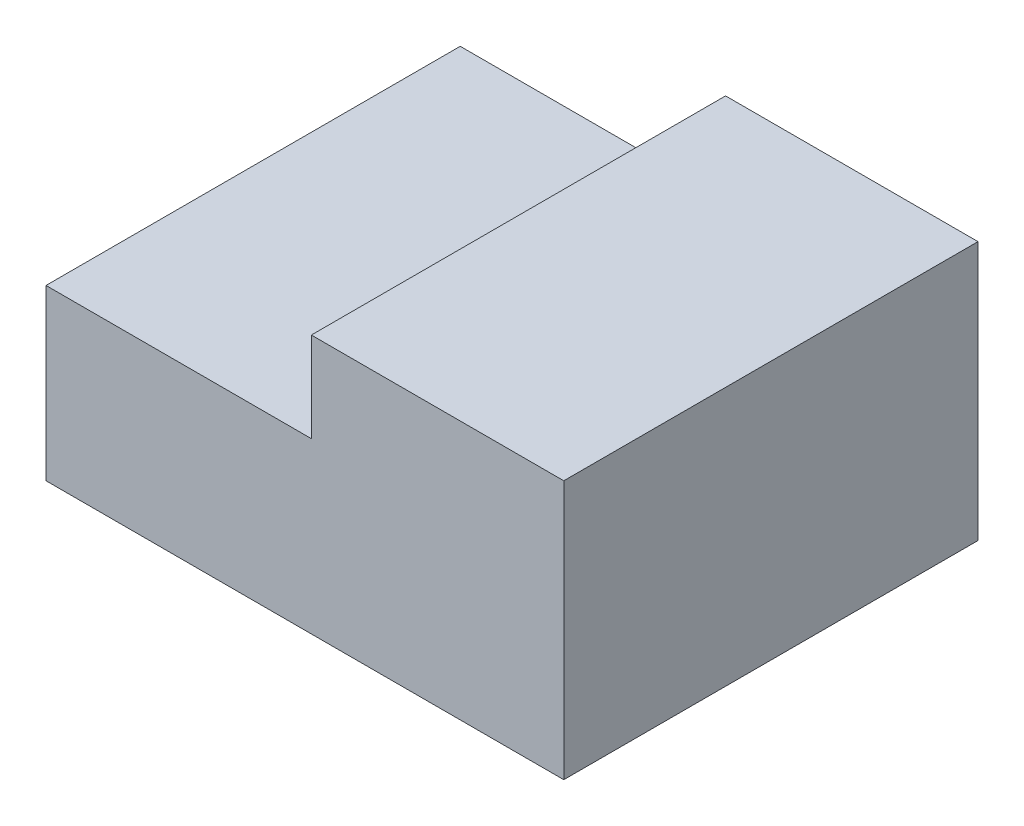
ISO-10303-21;
HEADER;
FILE_DESCRIPTION(('STEP AP214'),'2;1');
FILE_NAME('part.step','',(''),(''),'','','');
FILE_SCHEMA(('AUTOMOTIVE_DESIGN { 1 0 10303 214 1 1 1 1 }'));
ENDSEC;
DATA;
#1=APPLICATION_CONTEXT('core data for automotive mechanical design processes');
#2=APPLICATION_PROTOCOL_DEFINITION('international standard','automotive_design',2000,#1);
#3=PRODUCT_CONTEXT('',#1,'mechanical');
#4=PRODUCT('Part','Part','',(#3));
#5=PRODUCT_RELATED_PRODUCT_CATEGORY('part','',(#4));
#6=PRODUCT_DEFINITION_FORMATION('','',#4);
#7=PRODUCT_DEFINITION_CONTEXT('part definition',#1,'design');
#8=PRODUCT_DEFINITION('design','',#6,#7);
#9=PRODUCT_DEFINITION_SHAPE('','',#8);
#10=(LENGTH_UNIT() NAMED_UNIT(*) SI_UNIT(.MILLI.,.METRE.));
#11=(NAMED_UNIT(*) PLANE_ANGLE_UNIT() SI_UNIT($,.RADIAN.));
#12=(NAMED_UNIT(*) SI_UNIT($,.STERADIAN.) SOLID_ANGLE_UNIT());
#13=UNCERTAINTY_MEASURE_WITH_UNIT(LENGTH_MEASURE(1.E-05),#10,'distance_accuracy_value','');
#14=(GEOMETRIC_REPRESENTATION_CONTEXT(3) GLOBAL_UNCERTAINTY_ASSIGNED_CONTEXT((#13)) GLOBAL_UNIT_ASSIGNED_CONTEXT((#10,
#11,#12)) REPRESENTATION_CONTEXT('',''));
#15=CARTESIAN_POINT('',(0.,0.,0.));
#16=DIRECTION('',(0.,0.,1.));
#17=DIRECTION('',(1.,0.,0.));
#18=AXIS2_PLACEMENT_3D('',#15,#16,#17);
#19=CARTESIAN_POINT('',(-8.08109780569308,75.7063692621199,80.));
#20=DIRECTION('',(-1.,0.,0.));
#21=DIRECTION('',(0.,0.,1.));
#22=AXIS2_PLACEMENT_3D('',#19,#20,#21);
#23=PLANE('',#22);
#24=DIRECTION('',(0.,1.,0.));
#25=VECTOR('',#24,1.);
#26=CARTESIAN_POINT('',(-8.08109780569308,75.7063692621199,0.));
#27=LINE('',#26,#25);
#28=CARTESIAN_POINT('',(-8.08109780569308,25.7063692621199,0.));
#29=VERTEX_POINT('',#28);
#30=CARTESIAN_POINT('',(-8.08109780569308,75.7063692621199,0.));
#31=VERTEX_POINT('',#30);
#32=EDGE_CURVE('E112',#29,#31,#27,.T.);
#33=ORIENTED_EDGE('',*,*,#32,.T.);
#34=DIRECTION('',(0.,0.,-1.));
#35=VECTOR('',#34,1.);
#36=CARTESIAN_POINT('',(-8.08109780569308,75.7063692621199,80.));
#37=LINE('',#36,#35);
#38=CARTESIAN_POINT('',(-8.08109780569308,75.7063692621199,80.));
#39=VERTEX_POINT('',#38);
#40=EDGE_CURVE('E131',#39,#31,#37,.T.);
#41=ORIENTED_EDGE('',*,*,#40,.F.);
#42=DIRECTION('',(0.,1.,0.));
#43=VECTOR('',#42,1.);
#44=CARTESIAN_POINT('',(-8.08109780569308,75.7063692621199,80.));
#45=LINE('',#44,#43);
#46=CARTESIAN_POINT('',(-8.08109780569308,25.7063692621199,80.));
#47=VERTEX_POINT('',#46);
#48=EDGE_CURVE('E113',#47,#39,#45,.T.);
#49=ORIENTED_EDGE('',*,*,#48,.F.);
#50=DIRECTION('',(0.,0.,-1.));
#51=VECTOR('',#50,1.);
#52=CARTESIAN_POINT('',(-8.08109780569308,25.7063692621199,80.));
#53=LINE('',#52,#51);
#54=EDGE_CURVE('E119',#47,#29,#53,.T.);
#55=ORIENTED_EDGE('',*,*,#54,.T.);
#56=EDGE_LOOP('',(#33,#41,#49,#55));
#57=FACE_BOUND('',#56,.T.);
#58=ADVANCED_FACE('F33',(#57),#23,.F.);
#59=CARTESIAN_POINT('',(-108.081097805693,75.7063692621199,80.));
#60=DIRECTION('',(0.,-1.,0.));
#61=DIRECTION('',(0.,0.,-1.));
#62=AXIS2_PLACEMENT_3D('',#59,#60,#61);
#63=PLANE('',#62);
#64=DIRECTION('',(-1.,0.,0.));
#65=VECTOR('',#64,1.);
#66=CARTESIAN_POINT('',(-108.081097805693,75.7063692621199,0.));
#67=LINE('',#66,#65);
#68=CARTESIAN_POINT('',(-56.8332001179033,75.7063692621199,0.));
#69=VERTEX_POINT('',#68);
#70=EDGE_CURVE('E122',#31,#69,#67,.T.);
#71=ORIENTED_EDGE('',*,*,#70,.T.);
#72=DIRECTION('',(0.,0.,1.));
#73=VECTOR('',#72,1.);
#74=CARTESIAN_POINT('',(-56.8332001179033,75.7063692621199,80.));
#75=LINE('',#74,#73);
#76=CARTESIAN_POINT('',(-56.8332001179033,75.7063692621199,80.));
#77=VERTEX_POINT('',#76);
#78=EDGE_CURVE('E110',#69,#77,#75,.T.);
#79=ORIENTED_EDGE('',*,*,#78,.T.);
#80=DIRECTION('',(-1.,0.,0.));
#81=VECTOR('',#80,1.);
#82=CARTESIAN_POINT('',(-108.081097805693,75.7063692621199,80.));
#83=LINE('',#82,#81);
#84=EDGE_CURVE('E80',#39,#77,#83,.T.);
#85=ORIENTED_EDGE('',*,*,#84,.F.);
#86=ORIENTED_EDGE('',*,*,#40,.T.);
#87=EDGE_LOOP('',(#71,#79,#85,#86));
#88=FACE_BOUND('',#87,.T.);
#89=ADVANCED_FACE('F143',(#88),#63,.F.);
#90=CARTESIAN_POINT('',(-108.081097805693,75.7063692621199,80.));
#91=DIRECTION('',(1.,0.,0.));
#92=DIRECTION('',(0.,1.,0.));
#93=AXIS2_PLACEMENT_3D('',#90,#91,#92);
#94=PLANE('',#93);
#95=DIRECTION('',(0.,-1.,0.));
#96=VECTOR('',#95,1.);
#97=CARTESIAN_POINT('',(-108.081097805693,75.7063692621199,80.));
#98=LINE('',#97,#96);
#99=CARTESIAN_POINT('',(-108.081097805693,58.3772697547105,80.));
#100=VERTEX_POINT('',#99);
#101=CARTESIAN_POINT('',(-108.081097805693,25.7063692621199,80.));
#102=VERTEX_POINT('',#101);
#103=EDGE_CURVE('E116',#100,#102,#98,.T.);
#104=ORIENTED_EDGE('',*,*,#103,.F.);
#105=DIRECTION('',(0.,0.,-1.));
#106=VECTOR('',#105,1.);
#107=CARTESIAN_POINT('',(-108.081097805693,58.3772697547105,80.));
#108=LINE('',#107,#106);
#109=CARTESIAN_POINT('',(-108.081097805693,58.3772697547105,0.));
#110=VERTEX_POINT('',#109);
#111=EDGE_CURVE('E98',#100,#110,#108,.T.);
#112=ORIENTED_EDGE('',*,*,#111,.T.);
#113=DIRECTION('',(0.,-1.,0.));
#114=VECTOR('',#113,1.);
#115=CARTESIAN_POINT('',(-108.081097805693,75.7063692621199,0.));
#116=LINE('',#115,#114);
#117=CARTESIAN_POINT('',(-108.081097805693,25.7063692621199,0.));
#118=VERTEX_POINT('',#117);
#119=EDGE_CURVE('E125',#110,#118,#116,.T.);
#120=ORIENTED_EDGE('',*,*,#119,.T.);
#121=DIRECTION('',(0.,0.,-1.));
#122=VECTOR('',#121,1.);
#123=CARTESIAN_POINT('',(-108.081097805693,25.7063692621199,80.));
#124=LINE('',#123,#122);
#125=EDGE_CURVE('E129',#102,#118,#124,.T.);
#126=ORIENTED_EDGE('',*,*,#125,.F.);
#127=EDGE_LOOP('',(#104,#112,#120,#126));
#128=FACE_BOUND('',#127,.T.);
#129=ADVANCED_FACE('F136',(#128),#94,.F.);
#130=CARTESIAN_POINT('',(-108.081097805693,25.7063692621199,80.));
#131=DIRECTION('',(0.,1.,0.));
#132=DIRECTION('',(0.,0.,1.));
#133=AXIS2_PLACEMENT_3D('',#130,#131,#132);
#134=PLANE('',#133);
#135=DIRECTION('',(1.,0.,0.));
#136=VECTOR('',#135,1.);
#137=CARTESIAN_POINT('',(-108.081097805693,25.7063692621199,0.));
#138=LINE('',#137,#136);
#139=EDGE_CURVE('E73',#118,#29,#138,.T.);
#140=ORIENTED_EDGE('',*,*,#139,.T.);
#141=ORIENTED_EDGE('',*,*,#54,.F.);
#142=DIRECTION('',(1.,0.,0.));
#143=VECTOR('',#142,1.);
#144=CARTESIAN_POINT('',(-108.081097805693,25.7063692621199,80.));
#145=LINE('',#144,#143);
#146=EDGE_CURVE('E56',#102,#47,#145,.T.);
#147=ORIENTED_EDGE('',*,*,#146,.F.);
#148=ORIENTED_EDGE('',*,*,#125,.T.);
#149=EDGE_LOOP('',(#140,#141,#147,#148));
#150=FACE_BOUND('',#149,.T.);
#151=ADVANCED_FACE('F138',(#150),#134,.F.);
#152=CARTESIAN_POINT('',(0.,0.,80.));
#153=DIRECTION('',(0.,0.,1.));
#154=DIRECTION('',(1.,0.,0.));
#155=AXIS2_PLACEMENT_3D('',#152,#153,#154);
#156=PLANE('',#155);
#157=DIRECTION('',(0.,1.,0.));
#158=VECTOR('',#157,1.);
#159=CARTESIAN_POINT('',(-56.8332001179033,75.7063692621199,80.));
#160=LINE('',#159,#158);
#161=CARTESIAN_POINT('',(-56.8332001179033,58.3772697547105,80.));
#162=VERTEX_POINT('',#161);
#163=EDGE_CURVE('E96',#162,#77,#160,.T.);
#164=ORIENTED_EDGE('',*,*,#163,.F.);
#165=DIRECTION('',(1.,0.,0.));
#166=VECTOR('',#165,1.);
#167=CARTESIAN_POINT('',(-108.081097805693,58.3772697547105,80.));
#168=LINE('',#167,#166);
#169=EDGE_CURVE('E101',#100,#162,#168,.T.);
#170=ORIENTED_EDGE('',*,*,#169,.F.);
#171=ORIENTED_EDGE('',*,*,#103,.T.);
#172=ORIENTED_EDGE('',*,*,#146,.T.);
#173=ORIENTED_EDGE('',*,*,#48,.T.);
#174=ORIENTED_EDGE('',*,*,#84,.T.);
#175=EDGE_LOOP('',(#164,#170,#171,#172,#173,#174));
#176=FACE_BOUND('',#175,.T.);
#177=ADVANCED_FACE('F106',(#176),#156,.T.);
#178=CARTESIAN_POINT('',(0.,0.,0.));
#179=DIRECTION('',(0.,0.,1.));
#180=DIRECTION('',(1.,0.,0.));
#181=AXIS2_PLACEMENT_3D('',#178,#179,#180);
#182=PLANE('',#181);
#183=DIRECTION('',(1.,0.,0.));
#184=VECTOR('',#183,1.);
#185=CARTESIAN_POINT('',(0.,58.3772697547105,0.));
#186=LINE('',#185,#184);
#187=CARTESIAN_POINT('',(-56.8332001179033,58.3772697547105,0.));
#188=VERTEX_POINT('',#187);
#189=EDGE_CURVE('E40',#110,#188,#186,.T.);
#190=ORIENTED_EDGE('',*,*,#189,.T.);
#191=DIRECTION('',(0.,1.,0.));
#192=VECTOR('',#191,1.);
#193=CARTESIAN_POINT('',(-56.8332001179033,0.,0.));
#194=LINE('',#193,#192);
#195=EDGE_CURVE('E11',#188,#69,#194,.T.);
#196=ORIENTED_EDGE('',*,*,#195,.T.);
#197=ORIENTED_EDGE('',*,*,#70,.F.);
#198=ORIENTED_EDGE('',*,*,#32,.F.);
#199=ORIENTED_EDGE('',*,*,#139,.F.);
#200=ORIENTED_EDGE('',*,*,#119,.F.);
#201=EDGE_LOOP('',(#190,#196,#197,#198,#199,#200));
#202=FACE_BOUND('',#201,.T.);
#203=ADVANCED_FACE('F134',(#202),#182,.F.);
#204=CARTESIAN_POINT('',(-56.8332001179033,75.7063692621199,-20.));
#205=DIRECTION('',(1.,0.,0.));
#206=DIRECTION('',(0.,0.,-1.));
#207=AXIS2_PLACEMENT_3D('',#204,#205,#206);
#208=PLANE('',#207);
#209=ORIENTED_EDGE('',*,*,#195,.F.);
#210=DIRECTION('',(0.,0.,1.));
#211=VECTOR('',#210,1.);
#212=CARTESIAN_POINT('',(-56.8332001179033,58.3772697547105,-20.));
#213=LINE('',#212,#211);
#214=EDGE_CURVE('E47',#188,#162,#213,.T.);
#215=ORIENTED_EDGE('',*,*,#214,.T.);
#216=ORIENTED_EDGE('',*,*,#163,.T.);
#217=ORIENTED_EDGE('',*,*,#78,.F.);
#218=EDGE_LOOP('',(#209,#215,#216,#217));
#219=FACE_BOUND('',#218,.T.);
#220=ADVANCED_FACE('F94',(#219),#208,.F.);
#221=CARTESIAN_POINT('',(-108.081097805693,58.3772697547105,-20.));
#222=DIRECTION('',(0.,-1.,0.));
#223=DIRECTION('',(0.,0.,-1.));
#224=AXIS2_PLACEMENT_3D('',#221,#222,#223);
#225=PLANE('',#224);
#226=ORIENTED_EDGE('',*,*,#169,.T.);
#227=ORIENTED_EDGE('',*,*,#214,.F.);
#228=ORIENTED_EDGE('',*,*,#189,.F.);
#229=ORIENTED_EDGE('',*,*,#111,.F.);
#230=EDGE_LOOP('',(#226,#227,#228,#229));
#231=FACE_BOUND('',#230,.T.);
#232=ADVANCED_FACE('F102',(#231),#225,.F.);
#233=CLOSED_SHELL('',(#58,#89,#129,#151,#177,#203,#220,#232));
#234=MANIFOLD_SOLID_BREP('B2',#233);
#235=ADVANCED_BREP_SHAPE_REPRESENTATION('',(#18,#234),#14);
#236=SHAPE_DEFINITION_REPRESENTATION(#9,#235);
ENDSEC;
END-ISO-10303-21;
